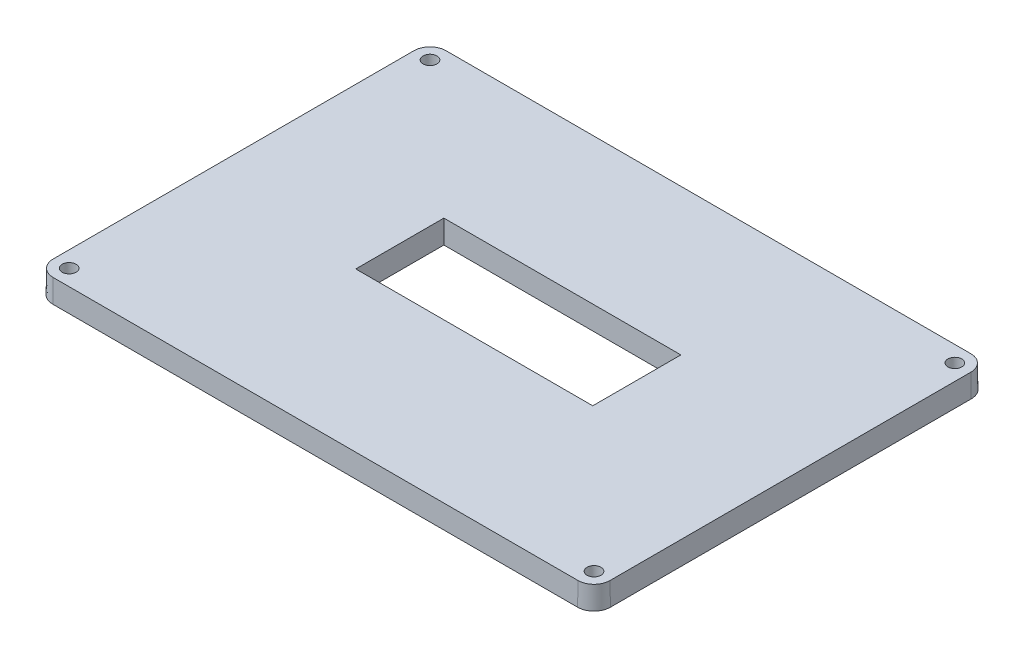
ISO-10303-21;
HEADER;
FILE_DESCRIPTION(('STEP AP214'),'2;1');
FILE_NAME('part.step','',(''),(''),'','','');
FILE_SCHEMA(('AUTOMOTIVE_DESIGN { 1 0 10303 214 1 1 1 1 }'));
ENDSEC;
DATA;
#1=APPLICATION_CONTEXT('core data for automotive mechanical design processes');
#2=APPLICATION_PROTOCOL_DEFINITION('international standard','automotive_design',2000,#1);
#3=PRODUCT_CONTEXT('',#1,'mechanical');
#4=PRODUCT('Part','Part','',(#3));
#5=PRODUCT_RELATED_PRODUCT_CATEGORY('part','',(#4));
#6=PRODUCT_DEFINITION_FORMATION('','',#4);
#7=PRODUCT_DEFINITION_CONTEXT('part definition',#1,'design');
#8=PRODUCT_DEFINITION('design','',#6,#7);
#9=PRODUCT_DEFINITION_SHAPE('','',#8);
#10=(LENGTH_UNIT() NAMED_UNIT(*) SI_UNIT(.MILLI.,.METRE.));
#11=(NAMED_UNIT(*) PLANE_ANGLE_UNIT() SI_UNIT($,.RADIAN.));
#12=(NAMED_UNIT(*) SI_UNIT($,.STERADIAN.) SOLID_ANGLE_UNIT());
#13=UNCERTAINTY_MEASURE_WITH_UNIT(LENGTH_MEASURE(1.E-05),#10,'distance_accuracy_value','');
#14=(GEOMETRIC_REPRESENTATION_CONTEXT(3) GLOBAL_UNCERTAINTY_ASSIGNED_CONTEXT((#13)) GLOBAL_UNIT_ASSIGNED_CONTEXT((#10,
#11,#12)) REPRESENTATION_CONTEXT('',''));
#15=CARTESIAN_POINT('',(0.,0.,0.));
#16=DIRECTION('',(0.,0.,1.));
#17=DIRECTION('',(1.,0.,0.));
#18=AXIS2_PLACEMENT_3D('',#15,#16,#17);
#19=CARTESIAN_POINT('',(-85.,0.,0.));
#20=DIRECTION('',(-0.999847695156391,0.0174524064372835,0.));
#21=DIRECTION('',(-0.0174524064372835,-0.999847695156391,0.));
#22=AXIS2_PLACEMENT_3D('',#19,#20,#21);
#23=PLANE('',#22);
#24=DIRECTION('',(0.,0.,-1.));
#25=VECTOR('',#24,1.);
#26=CARTESIAN_POINT('',(-85.,0.,0.));
#27=LINE('',#26,#25);
#28=CARTESIAN_POINT('',(-85.,0.,-55.));
#29=VERTEX_POINT('',#28);
#30=CARTESIAN_POINT('',(-85.,0.,55.));
#31=VERTEX_POINT('',#30);
#32=EDGE_CURVE('E216',#29,#31,#27,.F.);
#33=ORIENTED_EDGE('',*,*,#32,.T.);
#34=DIRECTION('',(-0.0174524064372835,-0.999847695156391,0.));
#35=VECTOR('',#34,1.);
#36=CARTESIAN_POINT('',(-85.,0.,55.));
#37=LINE('',#36,#35);
#38=CARTESIAN_POINT('',(-84.8778145455025,7.,55.));
#39=VERTEX_POINT('',#38);
#40=EDGE_CURVE('E11',#31,#39,#37,.F.);
#41=ORIENTED_EDGE('',*,*,#40,.T.);
#42=DIRECTION('',(0.,0.,-1.));
#43=VECTOR('',#42,1.);
#44=CARTESIAN_POINT('',(-84.8778145455025,7.,0.));
#45=LINE('',#44,#43);
#46=CARTESIAN_POINT('',(-84.8778145455025,7.,-55.));
#47=VERTEX_POINT('',#46);
#48=EDGE_CURVE('E205',#47,#39,#45,.F.);
#49=ORIENTED_EDGE('',*,*,#48,.F.);
#50=DIRECTION('',(-0.0174524064372835,-0.999847695156391,0.));
#51=VECTOR('',#50,1.);
#52=CARTESIAN_POINT('',(-85.,0.,-55.));
#53=LINE('',#52,#51);
#54=EDGE_CURVE('E52',#47,#29,#53,.T.);
#55=ORIENTED_EDGE('',*,*,#54,.T.);
#56=EDGE_LOOP('',(#33,#41,#49,#55));
#57=FACE_BOUND('',#56,.T.);
#58=ADVANCED_FACE('F42',(#57),#23,.T.);
#59=CARTESIAN_POINT('',(0.,0.,60.));
#60=DIRECTION('',(0.,0.0174524064372835,0.999847695156391));
#61=DIRECTION('',(0.,-0.999847695156391,0.0174524064372835));
#62=AXIS2_PLACEMENT_3D('',#59,#60,#61);
#63=PLANE('',#62);
#64=DIRECTION('',(-1.,0.,0.));
#65=VECTOR('',#64,1.);
#66=CARTESIAN_POINT('',(0.,0.,60.));
#67=LINE('',#66,#65);
#68=CARTESIAN_POINT('',(-80.,0.,60.));
#69=VERTEX_POINT('',#68);
#70=CARTESIAN_POINT('',(80.,0.,60.));
#71=VERTEX_POINT('',#70);
#72=EDGE_CURVE('E219',#69,#71,#67,.F.);
#73=ORIENTED_EDGE('',*,*,#72,.T.);
#74=DIRECTION('',(0.,-0.999847695156391,0.0174524064372835));
#75=VECTOR('',#74,1.);
#76=CARTESIAN_POINT('',(80.,0.,60.));
#77=LINE('',#76,#75);
#78=CARTESIAN_POINT('',(80.,7.,59.8778145455025));
#79=VERTEX_POINT('',#78);
#80=EDGE_CURVE('E46',#71,#79,#77,.F.);
#81=ORIENTED_EDGE('',*,*,#80,.T.);
#82=DIRECTION('',(-1.,0.,0.));
#83=VECTOR('',#82,1.);
#84=CARTESIAN_POINT('',(0.,7.,59.8778145455025));
#85=LINE('',#84,#83);
#86=CARTESIAN_POINT('',(-80.,7.,59.8778145455025));
#87=VERTEX_POINT('',#86);
#88=EDGE_CURVE('E202',#87,#79,#85,.F.);
#89=ORIENTED_EDGE('',*,*,#88,.F.);
#90=DIRECTION('',(0.,-0.999847695156391,0.0174524064372835));
#91=VECTOR('',#90,1.);
#92=CARTESIAN_POINT('',(-80.,0.,60.));
#93=LINE('',#92,#91);
#94=EDGE_CURVE('E210',#87,#69,#93,.T.);
#95=ORIENTED_EDGE('',*,*,#94,.T.);
#96=EDGE_LOOP('',(#73,#81,#89,#95));
#97=FACE_BOUND('',#96,.T.);
#98=ADVANCED_FACE('F278',(#97),#63,.T.);
#99=CARTESIAN_POINT('',(85.,0.,0.));
#100=DIRECTION('',(0.999847695156391,0.0174524064372835,0.));
#101=DIRECTION('',(-0.0174524064372835,0.999847695156391,0.));
#102=AXIS2_PLACEMENT_3D('',#99,#100,#101);
#103=PLANE('',#102);
#104=DIRECTION('',(0.,0.,1.));
#105=VECTOR('',#104,1.);
#106=CARTESIAN_POINT('',(85.,0.,0.));
#107=LINE('',#106,#105);
#108=CARTESIAN_POINT('',(85.,0.,55.));
#109=VERTEX_POINT('',#108);
#110=CARTESIAN_POINT('',(85.,0.,-55.));
#111=VERTEX_POINT('',#110);
#112=EDGE_CURVE('E223',#109,#111,#107,.F.);
#113=ORIENTED_EDGE('',*,*,#112,.T.);
#114=DIRECTION('',(0.0174524064372835,-0.999847695156391,0.));
#115=VECTOR('',#114,1.);
#116=CARTESIAN_POINT('',(85.,0.,-55.));
#117=LINE('',#116,#115);
#118=CARTESIAN_POINT('',(84.8778145455025,7.,-55.));
#119=VERTEX_POINT('',#118);
#120=EDGE_CURVE('E180',#111,#119,#117,.F.);
#121=ORIENTED_EDGE('',*,*,#120,.T.);
#122=DIRECTION('',(0.,0.,1.));
#123=VECTOR('',#122,1.);
#124=CARTESIAN_POINT('',(84.8778145455025,7.,0.));
#125=LINE('',#124,#123);
#126=CARTESIAN_POINT('',(84.8778145455025,7.,55.));
#127=VERTEX_POINT('',#126);
#128=EDGE_CURVE('E204',#127,#119,#125,.F.);
#129=ORIENTED_EDGE('',*,*,#128,.F.);
#130=DIRECTION('',(0.0174524064372835,-0.999847695156391,0.));
#131=VECTOR('',#130,1.);
#132=CARTESIAN_POINT('',(85.,0.,55.));
#133=LINE('',#132,#131);
#134=EDGE_CURVE('E182',#127,#109,#133,.T.);
#135=ORIENTED_EDGE('',*,*,#134,.T.);
#136=EDGE_LOOP('',(#113,#121,#129,#135));
#137=FACE_BOUND('',#136,.T.);
#138=ADVANCED_FACE('F281',(#137),#103,.T.);
#139=CARTESIAN_POINT('',(0.,0.,-60.));
#140=DIRECTION('',(0.,0.0174524064372835,-0.999847695156391));
#141=DIRECTION('',(0.,0.999847695156391,0.0174524064372835));
#142=AXIS2_PLACEMENT_3D('',#139,#140,#141);
#143=PLANE('',#142);
#144=DIRECTION('',(1.,0.,0.));
#145=VECTOR('',#144,1.);
#146=CARTESIAN_POINT('',(0.,7.,-59.8778145455025));
#147=LINE('',#146,#145);
#148=CARTESIAN_POINT('',(80.,7.,-59.8778145455025));
#149=VERTEX_POINT('',#148);
#150=CARTESIAN_POINT('',(-80.,7.,-59.8778145455025));
#151=VERTEX_POINT('',#150);
#152=EDGE_CURVE('E179',#149,#151,#147,.F.);
#153=ORIENTED_EDGE('',*,*,#152,.F.);
#154=DIRECTION('',(0.,-0.999847695156391,-0.0174524064372835));
#155=VECTOR('',#154,1.);
#156=CARTESIAN_POINT('',(80.,0.,-60.));
#157=LINE('',#156,#155);
#158=CARTESIAN_POINT('',(80.,0.,-60.));
#159=VERTEX_POINT('',#158);
#160=EDGE_CURVE('E178',#149,#159,#157,.T.);
#161=ORIENTED_EDGE('',*,*,#160,.T.);
#162=DIRECTION('',(1.,0.,0.));
#163=VECTOR('',#162,1.);
#164=CARTESIAN_POINT('',(0.,0.,-60.));
#165=LINE('',#164,#163);
#166=CARTESIAN_POINT('',(-80.,0.,-60.));
#167=VERTEX_POINT('',#166);
#168=EDGE_CURVE('E215',#159,#167,#165,.F.);
#169=ORIENTED_EDGE('',*,*,#168,.T.);
#170=DIRECTION('',(0.,-0.999847695156391,-0.0174524064372835));
#171=VECTOR('',#170,1.);
#172=CARTESIAN_POINT('',(-80.,0.,-60.));
#173=LINE('',#172,#171);
#174=EDGE_CURVE('E177',#167,#151,#173,.F.);
#175=ORIENTED_EDGE('',*,*,#174,.T.);
#176=EDGE_LOOP('',(#153,#161,#169,#175));
#177=FACE_BOUND('',#176,.T.);
#178=ADVANCED_FACE('F244',(#177),#143,.T.);
#179=CARTESIAN_POINT('',(0.,7.,0.));
#180=DIRECTION('',(0.,1.,0.));
#181=DIRECTION('',(0.,0.,1.));
#182=AXIS2_PLACEMENT_3D('',#179,#180,#181);
#183=PLANE('',#182);
#184=CARTESIAN_POINT('',(80.,7.,55.));
#185=DIRECTION('',(0.,1.,0.));
#186=DIRECTION('',(0.,0.,1.));
#187=AXIS2_PLACEMENT_3D('',#184,#185,#186);
#188=CIRCLE('',#187,2.12218545449752);
#189=CARTESIAN_POINT('',(80.,7.,57.1221854544975));
#190=VERTEX_POINT('',#189);
#191=EDGE_CURVE('E171',#190,#190,#188,.T.);
#192=ORIENTED_EDGE('',*,*,#191,.F.);
#193=EDGE_LOOP('',(#192));
#194=FACE_BOUND('',#193,.T.);
#195=CARTESIAN_POINT('',(80.,7.,-55.));
#196=DIRECTION('',(0.,1.,0.));
#197=DIRECTION('',(0.,0.,1.));
#198=AXIS2_PLACEMENT_3D('',#195,#196,#197);
#199=CIRCLE('',#198,2.12218545449752);
#200=CARTESIAN_POINT('',(80.,7.,-52.8778145455025));
#201=VERTEX_POINT('',#200);
#202=EDGE_CURVE('E166',#201,#201,#199,.T.);
#203=ORIENTED_EDGE('',*,*,#202,.F.);
#204=EDGE_LOOP('',(#203));
#205=FACE_BOUND('',#204,.T.);
#206=CARTESIAN_POINT('',(-80.,7.,55.));
#207=DIRECTION('',(0.,1.,0.));
#208=DIRECTION('',(0.,0.,1.));
#209=AXIS2_PLACEMENT_3D('',#206,#207,#208);
#210=CIRCLE('',#209,2.12218545449752);
#211=CARTESIAN_POINT('',(-80.,7.,57.1221854544975));
#212=VERTEX_POINT('',#211);
#213=EDGE_CURVE('E174',#212,#212,#210,.T.);
#214=ORIENTED_EDGE('',*,*,#213,.F.);
#215=EDGE_LOOP('',(#214));
#216=FACE_BOUND('',#215,.T.);
#217=CARTESIAN_POINT('',(-80.,7.,-55.));
#218=DIRECTION('',(0.,1.,0.));
#219=DIRECTION('',(0.,0.,1.));
#220=AXIS2_PLACEMENT_3D('',#217,#218,#219);
#221=CIRCLE('',#220,2.12218545449752);
#222=CARTESIAN_POINT('',(-80.,7.,-52.8778145455025));
#223=VERTEX_POINT('',#222);
#224=EDGE_CURVE('E161',#223,#223,#221,.T.);
#225=ORIENTED_EDGE('',*,*,#224,.F.);
#226=EDGE_LOOP('',(#225));
#227=FACE_BOUND('',#226,.T.);
#228=DIRECTION('',(0.,0.,1.));
#229=VECTOR('',#228,1.);
#230=CARTESIAN_POINT('',(36.1221854544975,7.,0.));
#231=LINE('',#230,#229);
#232=CARTESIAN_POINT('',(36.1221854544975,7.,11.5059807514573));
#233=VERTEX_POINT('',#232);
#234=CARTESIAN_POINT('',(36.1221854544975,7.,-15.3589576211975));
#235=VERTEX_POINT('',#234);
#236=EDGE_CURVE('E135',#233,#235,#231,.F.);
#237=ORIENTED_EDGE('',*,*,#236,.F.);
#238=DIRECTION('',(-1.,0.,0.));
#239=VECTOR('',#238,1.);
#240=CARTESIAN_POINT('',(0.,7.,11.5059807514573));
#241=LINE('',#240,#239);
#242=CARTESIAN_POINT('',(-36.1221854544975,7.,11.5059807514573));
#243=VERTEX_POINT('',#242);
#244=EDGE_CURVE('E153',#243,#233,#241,.F.);
#245=ORIENTED_EDGE('',*,*,#244,.F.);
#246=DIRECTION('',(0.,0.,-1.));
#247=VECTOR('',#246,1.);
#248=CARTESIAN_POINT('',(-36.1221854544975,7.,0.));
#249=LINE('',#248,#247);
#250=CARTESIAN_POINT('',(-36.1221854544975,7.,-15.3589576211975));
#251=VERTEX_POINT('',#250);
#252=EDGE_CURVE('E156',#251,#243,#249,.F.);
#253=ORIENTED_EDGE('',*,*,#252,.F.);
#254=DIRECTION('',(1.,0.,0.));
#255=VECTOR('',#254,1.);
#256=CARTESIAN_POINT('',(0.,7.,-15.3589576211975));
#257=LINE('',#256,#255);
#258=EDGE_CURVE('E232',#235,#251,#257,.F.);
#259=ORIENTED_EDGE('',*,*,#258,.F.);
#260=EDGE_LOOP('',(#237,#245,#253,#259));
#261=FACE_BOUND('',#260,.T.);
#262=ORIENTED_EDGE('',*,*,#128,.T.);
#263=CARTESIAN_POINT('',(80.,7.,-55.));
#264=DIRECTION('',(0.,1.,0.));
#265=DIRECTION('',(0.,0.,1.));
#266=AXIS2_PLACEMENT_3D('',#263,#264,#265);
#267=CIRCLE('',#266,4.87781454550248);
#268=EDGE_CURVE('E207',#119,#149,#267,.T.);
#269=ORIENTED_EDGE('',*,*,#268,.T.);
#270=ORIENTED_EDGE('',*,*,#152,.T.);
#271=CARTESIAN_POINT('',(-80.,7.,-55.));
#272=DIRECTION('',(0.,1.,0.));
#273=DIRECTION('',(0.,0.,1.));
#274=AXIS2_PLACEMENT_3D('',#271,#272,#273);
#275=CIRCLE('',#274,4.87781454550248);
#276=EDGE_CURVE('E181',#151,#47,#275,.T.);
#277=ORIENTED_EDGE('',*,*,#276,.T.);
#278=ORIENTED_EDGE('',*,*,#48,.T.);
#279=CARTESIAN_POINT('',(-80.,7.,55.));
#280=DIRECTION('',(0.,1.,0.));
#281=DIRECTION('',(0.,0.,1.));
#282=AXIS2_PLACEMENT_3D('',#279,#280,#281);
#283=CIRCLE('',#282,4.87781454550248);
#284=EDGE_CURVE('E188',#39,#87,#283,.T.);
#285=ORIENTED_EDGE('',*,*,#284,.T.);
#286=ORIENTED_EDGE('',*,*,#88,.T.);
#287=CARTESIAN_POINT('',(80.,7.,55.));
#288=DIRECTION('',(0.,1.,0.));
#289=DIRECTION('',(0.,0.,1.));
#290=AXIS2_PLACEMENT_3D('',#287,#288,#289);
#291=CIRCLE('',#290,4.87781454550248);
#292=EDGE_CURVE('E201',#79,#127,#291,.T.);
#293=ORIENTED_EDGE('',*,*,#292,.T.);
#294=EDGE_LOOP('',(#262,#269,#270,#277,#278,#285,#286,#293));
#295=FACE_BOUND('',#294,.T.);
#296=ADVANCED_FACE('F241',(#194,#205,#216,#227,#261,#295),#183,.T.);
#297=CARTESIAN_POINT('',(0.,0.,0.));
#298=DIRECTION('',(0.,1.,0.));
#299=DIRECTION('',(0.,0.,1.));
#300=AXIS2_PLACEMENT_3D('',#297,#298,#299);
#301=PLANE('',#300);
#302=CARTESIAN_POINT('',(80.,0.,55.));
#303=DIRECTION('',(0.,1.,0.));
#304=DIRECTION('',(0.,0.,1.));
#305=AXIS2_PLACEMENT_3D('',#302,#303,#304);
#306=CIRCLE('',#305,2.);
#307=CARTESIAN_POINT('',(80.,0.,57.));
#308=VERTEX_POINT('',#307);
#309=EDGE_CURVE('E170',#308,#308,#306,.T.);
#310=ORIENTED_EDGE('',*,*,#309,.T.);
#311=EDGE_LOOP('',(#310));
#312=FACE_BOUND('',#311,.T.);
#313=CARTESIAN_POINT('',(80.,0.,-55.));
#314=DIRECTION('',(0.,1.,0.));
#315=DIRECTION('',(0.,0.,1.));
#316=AXIS2_PLACEMENT_3D('',#313,#314,#315);
#317=CIRCLE('',#316,2.);
#318=CARTESIAN_POINT('',(80.,0.,-53.));
#319=VERTEX_POINT('',#318);
#320=EDGE_CURVE('E169',#319,#319,#317,.T.);
#321=ORIENTED_EDGE('',*,*,#320,.T.);
#322=EDGE_LOOP('',(#321));
#323=FACE_BOUND('',#322,.T.);
#324=CARTESIAN_POINT('',(-80.,0.,55.));
#325=DIRECTION('',(0.,1.,0.));
#326=DIRECTION('',(0.,0.,1.));
#327=AXIS2_PLACEMENT_3D('',#324,#325,#326);
#328=CIRCLE('',#327,2.);
#329=CARTESIAN_POINT('',(-80.,0.,57.));
#330=VERTEX_POINT('',#329);
#331=EDGE_CURVE('E165',#330,#330,#328,.T.);
#332=ORIENTED_EDGE('',*,*,#331,.T.);
#333=EDGE_LOOP('',(#332));
#334=FACE_BOUND('',#333,.T.);
#335=CARTESIAN_POINT('',(-80.,0.,-55.));
#336=DIRECTION('',(0.,1.,0.));
#337=DIRECTION('',(0.,0.,1.));
#338=AXIS2_PLACEMENT_3D('',#335,#336,#337);
#339=CIRCLE('',#338,2.);
#340=CARTESIAN_POINT('',(-80.,0.,-53.));
#341=VERTEX_POINT('',#340);
#342=EDGE_CURVE('E164',#341,#341,#339,.T.);
#343=ORIENTED_EDGE('',*,*,#342,.T.);
#344=EDGE_LOOP('',(#343));
#345=FACE_BOUND('',#344,.T.);
#346=DIRECTION('',(-1.,0.,0.));
#347=VECTOR('',#346,1.);
#348=CARTESIAN_POINT('',(0.,0.,11.3837952969598));
#349=LINE('',#348,#347);
#350=CARTESIAN_POINT('',(-36.,0.,11.3837952969598));
#351=VERTEX_POINT('',#350);
#352=CARTESIAN_POINT('',(36.,0.,11.3837952969598));
#353=VERTEX_POINT('',#352);
#354=EDGE_CURVE('E140',#351,#353,#349,.F.);
#355=ORIENTED_EDGE('',*,*,#354,.T.);
#356=DIRECTION('',(0.,0.,1.));
#357=VECTOR('',#356,1.);
#358=CARTESIAN_POINT('',(36.,0.,0.));
#359=LINE('',#358,#357);
#360=CARTESIAN_POINT('',(36.,0.,-15.2367721667));
#361=VERTEX_POINT('',#360);
#362=EDGE_CURVE('E132',#353,#361,#359,.F.);
#363=ORIENTED_EDGE('',*,*,#362,.T.);
#364=DIRECTION('',(1.,0.,0.));
#365=VECTOR('',#364,1.);
#366=CARTESIAN_POINT('',(0.,0.,-15.2367721667));
#367=LINE('',#366,#365);
#368=CARTESIAN_POINT('',(-36.,0.,-15.2367721667));
#369=VERTEX_POINT('',#368);
#370=EDGE_CURVE('E144',#361,#369,#367,.F.);
#371=ORIENTED_EDGE('',*,*,#370,.T.);
#372=DIRECTION('',(0.,0.,-1.));
#373=VECTOR('',#372,1.);
#374=CARTESIAN_POINT('',(-36.,0.,0.));
#375=LINE('',#374,#373);
#376=EDGE_CURVE('E148',#369,#351,#375,.F.);
#377=ORIENTED_EDGE('',*,*,#376,.T.);
#378=EDGE_LOOP('',(#355,#363,#371,#377));
#379=FACE_BOUND('',#378,.T.);
#380=ORIENTED_EDGE('',*,*,#168,.F.);
#381=CARTESIAN_POINT('',(80.,0.,-55.));
#382=DIRECTION('',(0.,1.,0.));
#383=DIRECTION('',(0.,0.,1.));
#384=AXIS2_PLACEMENT_3D('',#381,#382,#383);
#385=CIRCLE('',#384,5.);
#386=EDGE_CURVE('E191',#159,#111,#385,.F.);
#387=ORIENTED_EDGE('',*,*,#386,.T.);
#388=ORIENTED_EDGE('',*,*,#112,.F.);
#389=CARTESIAN_POINT('',(80.,0.,55.));
#390=DIRECTION('',(0.,1.,0.));
#391=DIRECTION('',(0.,0.,1.));
#392=AXIS2_PLACEMENT_3D('',#389,#390,#391);
#393=CIRCLE('',#392,5.);
#394=EDGE_CURVE('E195',#109,#71,#393,.F.);
#395=ORIENTED_EDGE('',*,*,#394,.T.);
#396=ORIENTED_EDGE('',*,*,#72,.F.);
#397=CARTESIAN_POINT('',(-80.,0.,55.));
#398=DIRECTION('',(0.,1.,0.));
#399=DIRECTION('',(0.,0.,1.));
#400=AXIS2_PLACEMENT_3D('',#397,#398,#399);
#401=CIRCLE('',#400,5.);
#402=EDGE_CURVE('E257',#69,#31,#401,.F.);
#403=ORIENTED_EDGE('',*,*,#402,.T.);
#404=ORIENTED_EDGE('',*,*,#32,.F.);
#405=CARTESIAN_POINT('',(-80.,0.,-55.));
#406=DIRECTION('',(0.,1.,0.));
#407=DIRECTION('',(0.,0.,1.));
#408=AXIS2_PLACEMENT_3D('',#405,#406,#407);
#409=CIRCLE('',#408,5.);
#410=EDGE_CURVE('E256',#29,#167,#409,.F.);
#411=ORIENTED_EDGE('',*,*,#410,.T.);
#412=EDGE_LOOP('',(#380,#387,#388,#395,#396,#403,#404,#411));
#413=FACE_BOUND('',#412,.T.);
#414=ADVANCED_FACE('F150',(#312,#323,#334,#345,#379,#413),#301,.F.);
#415=CARTESIAN_POINT('',(36.,0.,0.));
#416=DIRECTION('',(-0.999847695156391,0.0174524064372835,0.));
#417=DIRECTION('',(-0.0174524064372835,-0.999847695156391,0.));
#418=AXIS2_PLACEMENT_3D('',#415,#416,#417);
#419=PLANE('',#418);
#420=ORIENTED_EDGE('',*,*,#236,.T.);
#421=DIRECTION('',(0.0174497491606827,0.999695459881887,-0.0174497491606827));
#422=VECTOR('',#421,1.);
#423=CARTESIAN_POINT('',(35.9953604981695,-0.265796881854836,-15.2321326648695));
#424=LINE('',#423,#422);
#425=EDGE_CURVE('E128',#361,#235,#424,.T.);
#426=ORIENTED_EDGE('',*,*,#425,.F.);
#427=ORIENTED_EDGE('',*,*,#362,.F.);
#428=DIRECTION('',(0.0174497491606827,0.999695459881887,0.0174497491606827));
#429=VECTOR('',#428,1.);
#430=CARTESIAN_POINT('',(35.9890382251522,-0.627999660432442,11.372833522112));
#431=LINE('',#430,#429);
#432=EDGE_CURVE('E220',#353,#233,#431,.T.);
#433=ORIENTED_EDGE('',*,*,#432,.T.);
#434=EDGE_LOOP('',(#420,#426,#427,#433));
#435=FACE_BOUND('',#434,.T.);
#436=ADVANCED_FACE('F130',(#435),#419,.T.);
#437=CARTESIAN_POINT('',(0.,0.,11.3837952969598));
#438=DIRECTION('',(0.,0.0174524064372835,-0.999847695156391));
#439=DIRECTION('',(0.,0.999847695156391,0.0174524064372835));
#440=AXIS2_PLACEMENT_3D('',#437,#438,#439);
#441=PLANE('',#440);
#442=ORIENTED_EDGE('',*,*,#244,.T.);
#443=ORIENTED_EDGE('',*,*,#432,.F.);
#444=ORIENTED_EDGE('',*,*,#354,.F.);
#445=DIRECTION('',(-0.0174497491606827,0.999695459881887,0.0174497491606827));
#446=VECTOR('',#445,1.);
#447=CARTESIAN_POINT('',(-35.9965337055289,-0.198583877247866,11.3803290024887));
#448=LINE('',#447,#446);
#449=EDGE_CURVE('E226',#351,#243,#448,.T.);
#450=ORIENTED_EDGE('',*,*,#449,.T.);
#451=EDGE_LOOP('',(#442,#443,#444,#450));
#452=FACE_BOUND('',#451,.T.);
#453=ADVANCED_FACE('F44',(#452),#441,.T.);
#454=CARTESIAN_POINT('',(-36.,0.,0.));
#455=DIRECTION('',(0.999847695156391,0.0174524064372835,0.));
#456=DIRECTION('',(-0.0174524064372835,0.999847695156391,0.));
#457=AXIS2_PLACEMENT_3D('',#454,#455,#456);
#458=PLANE('',#457);
#459=ORIENTED_EDGE('',*,*,#252,.T.);
#460=ORIENTED_EDGE('',*,*,#449,.F.);
#461=ORIENTED_EDGE('',*,*,#376,.F.);
#462=DIRECTION('',(-0.0174497491606827,0.999695459881887,-0.0174497491606827));
#463=VECTOR('',#462,1.);
#464=CARTESIAN_POINT('',(-35.9890382251522,-0.627999660432442,-15.2258103918523));
#465=LINE('',#464,#463);
#466=EDGE_CURVE('E139',#369,#251,#465,.T.);
#467=ORIENTED_EDGE('',*,*,#466,.T.);
#468=EDGE_LOOP('',(#459,#460,#461,#467));
#469=FACE_BOUND('',#468,.T.);
#470=ADVANCED_FACE('F236',(#469),#458,.T.);
#471=CARTESIAN_POINT('',(0.,0.,-15.2367721667));
#472=DIRECTION('',(0.,0.0174524064372835,0.999847695156391));
#473=DIRECTION('',(0.,-0.999847695156391,0.0174524064372835));
#474=AXIS2_PLACEMENT_3D('',#471,#472,#473);
#475=PLANE('',#474);
#476=ORIENTED_EDGE('',*,*,#258,.T.);
#477=ORIENTED_EDGE('',*,*,#466,.F.);
#478=ORIENTED_EDGE('',*,*,#370,.F.);
#479=ORIENTED_EDGE('',*,*,#425,.T.);
#480=EDGE_LOOP('',(#476,#477,#478,#479));
#481=FACE_BOUND('',#480,.T.);
#482=ADVANCED_FACE('F145',(#481),#475,.T.);
#483=CARTESIAN_POINT('',(-80.,0.,-55.));
#484=DIRECTION('',(0.,1.,0.));
#485=DIRECTION('',(0.,0.,1.));
#486=AXIS2_PLACEMENT_3D('',#483,#484,#485);
#487=CONICAL_SURFACE('',#486,2.,0.0174532925199433);
#488=ORIENTED_EDGE('',*,*,#342,.F.);
#489=EDGE_LOOP('',(#488));
#490=FACE_BOUND('',#489,.T.);
#491=ORIENTED_EDGE('',*,*,#224,.T.);
#492=EDGE_LOOP('',(#491));
#493=FACE_BOUND('',#492,.T.);
#494=ADVANCED_FACE('F319',(#490,#493),#487,.F.);
#495=CARTESIAN_POINT('',(-80.,0.,55.));
#496=DIRECTION('',(0.,1.,0.));
#497=DIRECTION('',(0.,0.,1.));
#498=AXIS2_PLACEMENT_3D('',#495,#496,#497);
#499=CONICAL_SURFACE('',#498,2.,0.0174532925199433);
#500=ORIENTED_EDGE('',*,*,#213,.T.);
#501=EDGE_LOOP('',(#500));
#502=FACE_BOUND('',#501,.T.);
#503=ORIENTED_EDGE('',*,*,#331,.F.);
#504=EDGE_LOOP('',(#503));
#505=FACE_BOUND('',#504,.T.);
#506=ADVANCED_FACE('F313',(#502,#505),#499,.F.);
#507=CARTESIAN_POINT('',(80.,0.,-55.));
#508=DIRECTION('',(0.,1.,0.));
#509=DIRECTION('',(0.,0.,1.));
#510=AXIS2_PLACEMENT_3D('',#507,#508,#509);
#511=CONICAL_SURFACE('',#510,2.,0.0174532925199433);
#512=ORIENTED_EDGE('',*,*,#202,.T.);
#513=EDGE_LOOP('',(#512));
#514=FACE_BOUND('',#513,.T.);
#515=ORIENTED_EDGE('',*,*,#320,.F.);
#516=EDGE_LOOP('',(#515));
#517=FACE_BOUND('',#516,.T.);
#518=ADVANCED_FACE('F307',(#514,#517),#511,.F.);
#519=CARTESIAN_POINT('',(80.,0.,55.));
#520=DIRECTION('',(0.,1.,0.));
#521=DIRECTION('',(0.,0.,1.));
#522=AXIS2_PLACEMENT_3D('',#519,#520,#521);
#523=CONICAL_SURFACE('',#522,2.,0.0174532925199433);
#524=ORIENTED_EDGE('',*,*,#191,.T.);
#525=EDGE_LOOP('',(#524));
#526=FACE_BOUND('',#525,.T.);
#527=ORIENTED_EDGE('',*,*,#309,.F.);
#528=EDGE_LOOP('',(#527));
#529=FACE_BOUND('',#528,.T.);
#530=ADVANCED_FACE('F302',(#526,#529),#523,.F.);
#531=CARTESIAN_POINT('',(80.,0.,-55.));
#532=DIRECTION('',(0.,-1.,0.));
#533=DIRECTION('',(0.,0.,1.));
#534=AXIS2_PLACEMENT_3D('',#531,#532,#533);
#535=CONICAL_SURFACE('',#534,5.,0.0174532925199433);
#536=ORIENTED_EDGE('',*,*,#268,.F.);
#537=ORIENTED_EDGE('',*,*,#120,.F.);
#538=ORIENTED_EDGE('',*,*,#386,.F.);
#539=ORIENTED_EDGE('',*,*,#160,.F.);
#540=EDGE_LOOP('',(#536,#537,#538,#539));
#541=FACE_BOUND('',#540,.T.);
#542=ADVANCED_FACE('F252',(#541),#535,.T.);
#543=CARTESIAN_POINT('',(80.,0.,55.));
#544=DIRECTION('',(0.,-1.,0.));
#545=DIRECTION('',(0.,0.,1.));
#546=AXIS2_PLACEMENT_3D('',#543,#544,#545);
#547=CONICAL_SURFACE('',#546,5.,0.0174532925199433);
#548=ORIENTED_EDGE('',*,*,#292,.F.);
#549=ORIENTED_EDGE('',*,*,#80,.F.);
#550=ORIENTED_EDGE('',*,*,#394,.F.);
#551=ORIENTED_EDGE('',*,*,#134,.F.);
#552=EDGE_LOOP('',(#548,#549,#550,#551));
#553=FACE_BOUND('',#552,.T.);
#554=ADVANCED_FACE('F280',(#553),#547,.T.);
#555=CARTESIAN_POINT('',(-80.,0.,55.));
#556=DIRECTION('',(0.,-1.,0.));
#557=DIRECTION('',(0.,0.,1.));
#558=AXIS2_PLACEMENT_3D('',#555,#556,#557);
#559=CONICAL_SURFACE('',#558,5.,0.0174532925199433);
#560=ORIENTED_EDGE('',*,*,#284,.F.);
#561=ORIENTED_EDGE('',*,*,#40,.F.);
#562=ORIENTED_EDGE('',*,*,#402,.F.);
#563=ORIENTED_EDGE('',*,*,#94,.F.);
#564=EDGE_LOOP('',(#560,#561,#562,#563));
#565=FACE_BOUND('',#564,.T.);
#566=ADVANCED_FACE('F277',(#565),#559,.T.);
#567=CARTESIAN_POINT('',(-80.,0.,-55.));
#568=DIRECTION('',(0.,-1.,0.));
#569=DIRECTION('',(0.,0.,1.));
#570=AXIS2_PLACEMENT_3D('',#567,#568,#569);
#571=CONICAL_SURFACE('',#570,5.,0.0174532925199433);
#572=ORIENTED_EDGE('',*,*,#276,.F.);
#573=ORIENTED_EDGE('',*,*,#174,.F.);
#574=ORIENTED_EDGE('',*,*,#410,.F.);
#575=ORIENTED_EDGE('',*,*,#54,.F.);
#576=EDGE_LOOP('',(#572,#573,#574,#575));
#577=FACE_BOUND('',#576,.T.);
#578=ADVANCED_FACE('F299',(#577),#571,.T.);
#579=CLOSED_SHELL('',(#58,#98,#138,#178,#296,#414,#436,#453,#470,#482,#494,#506,#518,#530,#542,
#554,#566,#578));
#580=MANIFOLD_SOLID_BREP('B2',#579);
#581=ADVANCED_BREP_SHAPE_REPRESENTATION('',(#18,#580),#14);
#582=SHAPE_DEFINITION_REPRESENTATION(#9,#581);
ENDSEC;
END-ISO-10303-21;
